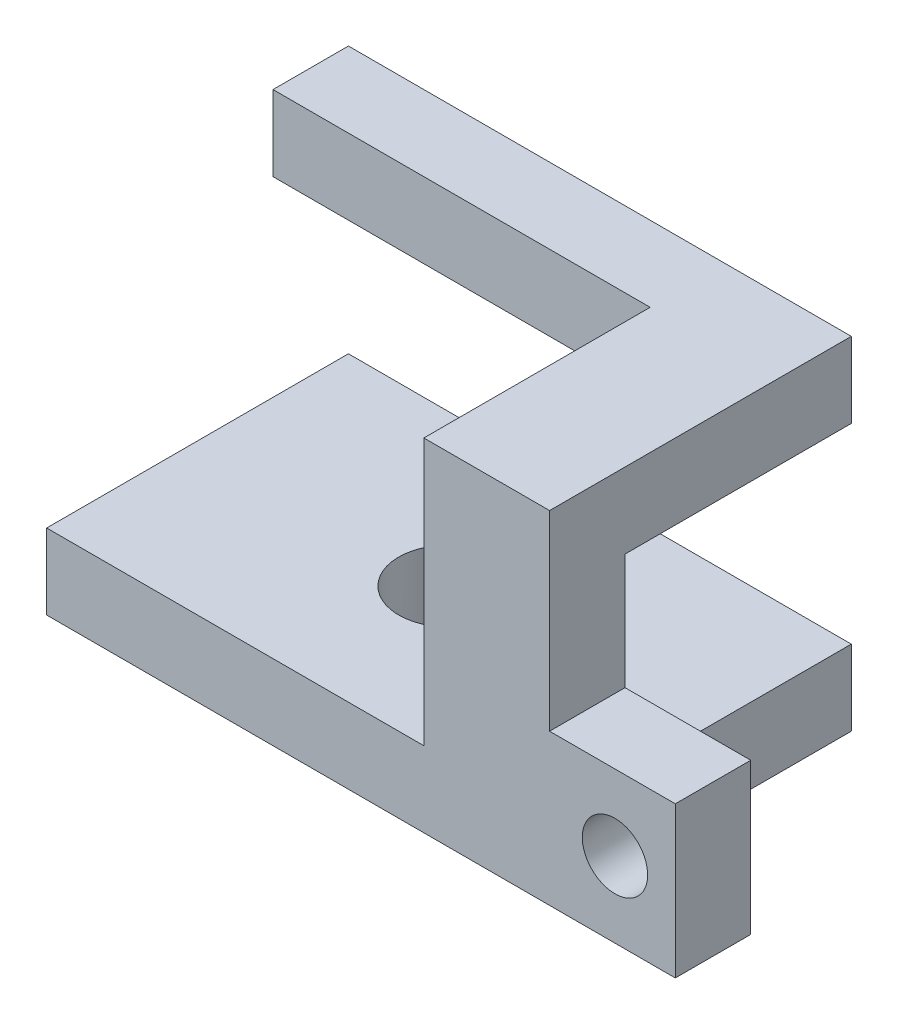
ISO-10303-21;
HEADER;
FILE_DESCRIPTION(('STEP AP214'),'2;1');
FILE_NAME('part.step','',(''),(''),'','','');
FILE_SCHEMA(('AUTOMOTIVE_DESIGN { 1 0 10303 214 1 1 1 1 }'));
ENDSEC;
DATA;
#1=APPLICATION_CONTEXT('core data for automotive mechanical design processes');
#2=APPLICATION_PROTOCOL_DEFINITION('international standard','automotive_design',2000,#1);
#3=PRODUCT_CONTEXT('',#1,'mechanical');
#4=PRODUCT('Part','Part','',(#3));
#5=PRODUCT_RELATED_PRODUCT_CATEGORY('part','',(#4));
#6=PRODUCT_DEFINITION_FORMATION('','',#4);
#7=PRODUCT_DEFINITION_CONTEXT('part definition',#1,'design');
#8=PRODUCT_DEFINITION('design','',#6,#7);
#9=PRODUCT_DEFINITION_SHAPE('','',#8);
#10=(LENGTH_UNIT() NAMED_UNIT(*) SI_UNIT(.MILLI.,.METRE.));
#11=(NAMED_UNIT(*) PLANE_ANGLE_UNIT() SI_UNIT($,.RADIAN.));
#12=(NAMED_UNIT(*) SI_UNIT($,.STERADIAN.) SOLID_ANGLE_UNIT());
#13=UNCERTAINTY_MEASURE_WITH_UNIT(LENGTH_MEASURE(1.E-05),#10,'distance_accuracy_value','');
#14=(GEOMETRIC_REPRESENTATION_CONTEXT(3) GLOBAL_UNCERTAINTY_ASSIGNED_CONTEXT((#13)) GLOBAL_UNIT_ASSIGNED_CONTEXT((#10,
#11,#12)) REPRESENTATION_CONTEXT('',''));
#15=CARTESIAN_POINT('',(0.,0.,0.));
#16=DIRECTION('',(0.,0.,1.));
#17=DIRECTION('',(1.,0.,0.));
#18=AXIS2_PLACEMENT_3D('',#15,#16,#17);
#19=CARTESIAN_POINT('',(-50.,68.,30.));
#20=DIRECTION('',(1.,0.,0.));
#21=DIRECTION('',(0.,0.,-1.));
#22=AXIS2_PLACEMENT_3D('',#19,#20,#21);
#23=PLANE('',#22);
#24=DIRECTION('',(0.,-1.,0.));
#25=VECTOR('',#24,1.);
#26=CARTESIAN_POINT('',(-50.,68.,30.));
#27=LINE('',#26,#25);
#28=CARTESIAN_POINT('',(-50.,15.,30.));
#29=VERTEX_POINT('',#28);
#30=CARTESIAN_POINT('',(-50.,0.,30.));
#31=VERTEX_POINT('',#30);
#32=EDGE_CURVE('E167',#29,#31,#27,.T.);
#33=ORIENTED_EDGE('',*,*,#32,.F.);
#34=DIRECTION('',(0.,0.,-1.));
#35=VECTOR('',#34,1.);
#36=CARTESIAN_POINT('',(-50.,15.,-30.));
#37=LINE('',#36,#35);
#38=CARTESIAN_POINT('',(-50.,15.,-30.));
#39=VERTEX_POINT('',#38);
#40=EDGE_CURVE('E202',#29,#39,#37,.T.);
#41=ORIENTED_EDGE('',*,*,#40,.T.);
#42=DIRECTION('',(0.,-1.,0.));
#43=VECTOR('',#42,1.);
#44=CARTESIAN_POINT('',(-50.,68.,-30.));
#45=LINE('',#44,#43);
#46=CARTESIAN_POINT('',(-50.,0.,-30.));
#47=VERTEX_POINT('',#46);
#48=EDGE_CURVE('E170',#39,#47,#45,.T.);
#49=ORIENTED_EDGE('',*,*,#48,.T.);
#50=DIRECTION('',(0.,0.,1.));
#51=VECTOR('',#50,1.);
#52=CARTESIAN_POINT('',(-50.,0.,30.));
#53=LINE('',#52,#51);
#54=EDGE_CURVE('E227',#47,#31,#53,.T.);
#55=ORIENTED_EDGE('',*,*,#54,.T.);
#56=EDGE_LOOP('',(#33,#41,#49,#55));
#57=FACE_BOUND('',#56,.T.);
#58=ADVANCED_FACE('F40',(#57),#23,.F.);
#59=CARTESIAN_POINT('',(-50.,68.,-30.));
#60=DIRECTION('',(0.,0.,1.));
#61=DIRECTION('',(1.,0.,0.));
#62=AXIS2_PLACEMENT_3D('',#59,#60,#61);
#63=PLANE('',#62);
#64=DIRECTION('',(1.,0.,0.));
#65=VECTOR('',#64,1.);
#66=CARTESIAN_POINT('',(-50.,15.,-30.));
#67=LINE('',#66,#65);
#68=CARTESIAN_POINT('',(50.,15.,-30.));
#69=VERTEX_POINT('',#68);
#70=EDGE_CURVE('E187',#39,#69,#67,.T.);
#71=ORIENTED_EDGE('',*,*,#70,.T.);
#72=DIRECTION('',(0.,1.,0.));
#73=VECTOR('',#72,1.);
#74=CARTESIAN_POINT('',(50.,0.,-30.));
#75=LINE('',#74,#73);
#76=CARTESIAN_POINT('',(50.,0.,-30.));
#77=VERTEX_POINT('',#76);
#78=EDGE_CURVE('E239',#77,#69,#75,.T.);
#79=ORIENTED_EDGE('',*,*,#78,.F.);
#80=DIRECTION('',(-1.,0.,0.));
#81=VECTOR('',#80,1.);
#82=CARTESIAN_POINT('',(-50.,0.,-30.));
#83=LINE('',#82,#81);
#84=EDGE_CURVE('E222',#77,#47,#83,.T.);
#85=ORIENTED_EDGE('',*,*,#84,.T.);
#86=ORIENTED_EDGE('',*,*,#48,.F.);
#87=EDGE_LOOP('',(#71,#79,#85,#86));
#88=FACE_BOUND('',#87,.T.);
#89=ADVANCED_FACE('F289',(#88),#63,.F.);
#90=CARTESIAN_POINT('',(0.,68.,0.));
#91=DIRECTION('',(0.,-1.,0.));
#92=DIRECTION('',(0.,0.,-1.));
#93=AXIS2_PLACEMENT_3D('',#90,#91,#92);
#94=CYLINDRICAL_SURFACE('',#93,10.);
#95=CARTESIAN_POINT('',(0.,15.,0.));
#96=DIRECTION('',(0.,-1.,0.));
#97=DIRECTION('',(0.,0.,-1.));
#98=AXIS2_PLACEMENT_3D('',#95,#96,#97);
#99=CIRCLE('',#98,10.);
#100=CARTESIAN_POINT('',(0.,15.,-10.));
#101=VERTEX_POINT('',#100);
#102=EDGE_CURVE('E183',#101,#101,#99,.T.);
#103=ORIENTED_EDGE('',*,*,#102,.F.);
#104=EDGE_LOOP('',(#103));
#105=FACE_BOUND('',#104,.T.);
#106=CARTESIAN_POINT('',(0.,0.,0.));
#107=DIRECTION('',(0.,1.,0.));
#108=DIRECTION('',(0.,0.,1.));
#109=AXIS2_PLACEMENT_3D('',#106,#107,#108);
#110=CIRCLE('',#109,10.);
#111=CARTESIAN_POINT('',(0.,0.,10.));
#112=VERTEX_POINT('',#111);
#113=EDGE_CURVE('E186',#112,#112,#110,.T.);
#114=ORIENTED_EDGE('',*,*,#113,.F.);
#115=EDGE_LOOP('',(#114));
#116=FACE_BOUND('',#115,.T.);
#117=ADVANCED_FACE('F305',(#105,#116),#94,.F.);
#118=CARTESIAN_POINT('',(0.,68.,0.));
#119=DIRECTION('',(0.,-1.,0.));
#120=DIRECTION('',(0.,0.,-1.));
#121=AXIS2_PLACEMENT_3D('',#118,#119,#120);
#122=PLANE('',#121);
#123=DIRECTION('',(1.,0.,0.));
#124=VECTOR('',#123,1.);
#125=CARTESIAN_POINT('',(-50.,68.,30.));
#126=LINE('',#125,#124);
#127=CARTESIAN_POINT('',(25.,68.,30.));
#128=VERTEX_POINT('',#127);
#129=CARTESIAN_POINT('',(50.,68.,30.));
#130=VERTEX_POINT('',#129);
#131=EDGE_CURVE('E168',#128,#130,#126,.T.);
#132=ORIENTED_EDGE('',*,*,#131,.T.);
#133=DIRECTION('',(0.,0.,1.));
#134=VECTOR('',#133,1.);
#135=CARTESIAN_POINT('',(50.,68.,-30.));
#136=LINE('',#135,#134);
#137=CARTESIAN_POINT('',(50.,68.,-30.));
#138=VERTEX_POINT('',#137);
#139=EDGE_CURVE('E255',#138,#130,#136,.T.);
#140=ORIENTED_EDGE('',*,*,#139,.F.);
#141=DIRECTION('',(-1.,0.,0.));
#142=VECTOR('',#141,1.);
#143=CARTESIAN_POINT('',(50.,68.,-30.));
#144=LINE('',#143,#142);
#145=CARTESIAN_POINT('',(-50.,68.,-30.));
#146=VERTEX_POINT('',#145);
#147=EDGE_CURVE('E223',#138,#146,#144,.T.);
#148=ORIENTED_EDGE('',*,*,#147,.T.);
#149=DIRECTION('',(0.,0.,1.));
#150=VECTOR('',#149,1.);
#151=CARTESIAN_POINT('',(-50.,68.,30.));
#152=LINE('',#151,#150);
#153=CARTESIAN_POINT('',(-50.,68.,-15.));
#154=VERTEX_POINT('',#153);
#155=EDGE_CURVE('E173',#146,#154,#152,.T.);
#156=ORIENTED_EDGE('',*,*,#155,.T.);
#157=DIRECTION('',(-1.,0.,0.));
#158=VECTOR('',#157,1.);
#159=CARTESIAN_POINT('',(-50.,68.,-15.));
#160=LINE('',#159,#158);
#161=CARTESIAN_POINT('',(25.,68.,-15.));
#162=VERTEX_POINT('',#161);
#163=EDGE_CURVE('E249',#162,#154,#160,.T.);
#164=ORIENTED_EDGE('',*,*,#163,.F.);
#165=DIRECTION('',(0.,0.,-1.));
#166=VECTOR('',#165,1.);
#167=CARTESIAN_POINT('',(25.,68.,-15.));
#168=LINE('',#167,#166);
#169=EDGE_CURVE('E252',#128,#162,#168,.T.);
#170=ORIENTED_EDGE('',*,*,#169,.F.);
#171=EDGE_LOOP('',(#132,#140,#148,#156,#164,#170));
#172=FACE_BOUND('',#171,.T.);
#173=ADVANCED_FACE('F276',(#172),#122,.F.);
#174=CARTESIAN_POINT('',(0.,0.,0.));
#175=DIRECTION('',(0.,-1.,0.));
#176=DIRECTION('',(0.,0.,-1.));
#177=AXIS2_PLACEMENT_3D('',#174,#175,#176);
#178=PLANE('',#177);
#179=DIRECTION('',(0.,0.,1.));
#180=VECTOR('',#179,1.);
#181=CARTESIAN_POINT('',(50.,0.,0.));
#182=LINE('',#181,#180);
#183=CARTESIAN_POINT('',(50.,0.,15.));
#184=VERTEX_POINT('',#183);
#185=EDGE_CURVE('E237',#77,#184,#182,.T.);
#186=ORIENTED_EDGE('',*,*,#185,.T.);
#187=DIRECTION('',(1.,0.,0.));
#188=VECTOR('',#187,1.);
#189=CARTESIAN_POINT('',(0.,0.,15.));
#190=LINE('',#189,#188);
#191=CARTESIAN_POINT('',(75.,0.,15.));
#192=VERTEX_POINT('',#191);
#193=EDGE_CURVE('E235',#184,#192,#190,.T.);
#194=ORIENTED_EDGE('',*,*,#193,.T.);
#195=DIRECTION('',(0.,0.,-1.));
#196=VECTOR('',#195,1.);
#197=CARTESIAN_POINT('',(75.,0.,-30.));
#198=LINE('',#197,#196);
#199=CARTESIAN_POINT('',(75.,0.,30.));
#200=VERTEX_POINT('',#199);
#201=EDGE_CURVE('E176',#200,#192,#198,.T.);
#202=ORIENTED_EDGE('',*,*,#201,.F.);
#203=DIRECTION('',(1.,0.,0.));
#204=VECTOR('',#203,1.);
#205=CARTESIAN_POINT('',(50.,0.,30.));
#206=LINE('',#205,#204);
#207=EDGE_CURVE('E165',#31,#200,#206,.T.);
#208=ORIENTED_EDGE('',*,*,#207,.F.);
#209=ORIENTED_EDGE('',*,*,#54,.F.);
#210=ORIENTED_EDGE('',*,*,#84,.F.);
#211=EDGE_LOOP('',(#186,#194,#202,#208,#209,#210));
#212=FACE_BOUND('',#211,.T.);
#213=ORIENTED_EDGE('',*,*,#113,.T.);
#214=EDGE_LOOP('',(#213));
#215=FACE_BOUND('',#214,.T.);
#216=ADVANCED_FACE('F232',(#212,#215),#178,.T.);
#217=ORIENTED_EDGE('',*,*,#147,.F.);
#218=DIRECTION('',(0.,1.,0.));
#219=VECTOR('',#218,1.);
#220=CARTESIAN_POINT('',(50.,-72.4642784226795,-30.));
#221=LINE('',#220,#219);
#222=CARTESIAN_POINT('',(50.,53.,-30.));
#223=VERTEX_POINT('',#222);
#224=EDGE_CURVE('E248',#223,#138,#221,.T.);
#225=ORIENTED_EDGE('',*,*,#224,.F.);
#226=DIRECTION('',(1.,0.,0.));
#227=VECTOR('',#226,1.);
#228=CARTESIAN_POINT('',(-50.,53.,-30.));
#229=LINE('',#228,#227);
#230=CARTESIAN_POINT('',(-50.,53.,-30.));
#231=VERTEX_POINT('',#230);
#232=EDGE_CURVE('E204',#231,#223,#229,.T.);
#233=ORIENTED_EDGE('',*,*,#232,.F.);
#234=EDGE_CURVE('E179',#146,#231,#45,.T.);
#235=ORIENTED_EDGE('',*,*,#234,.F.);
#236=EDGE_LOOP('',(#217,#225,#233,#235));
#237=FACE_BOUND('',#236,.T.);
#238=ADVANCED_FACE('F42',(#237),#63,.F.);
#239=DIRECTION('',(0.,0.,1.));
#240=VECTOR('',#239,1.);
#241=CARTESIAN_POINT('',(-50.,53.,-30.));
#242=LINE('',#241,#240);
#243=CARTESIAN_POINT('',(-50.,53.,-15.));
#244=VERTEX_POINT('',#243);
#245=EDGE_CURVE('E194',#231,#244,#242,.T.);
#246=ORIENTED_EDGE('',*,*,#245,.T.);
#247=DIRECTION('',(0.,1.,0.));
#248=VECTOR('',#247,1.);
#249=CARTESIAN_POINT('',(-50.,-72.4642784226795,-15.));
#250=LINE('',#249,#248);
#251=EDGE_CURVE('E63',#244,#154,#250,.T.);
#252=ORIENTED_EDGE('',*,*,#251,.T.);
#253=ORIENTED_EDGE('',*,*,#155,.F.);
#254=ORIENTED_EDGE('',*,*,#234,.T.);
#255=EDGE_LOOP('',(#246,#252,#253,#254));
#256=FACE_BOUND('',#255,.T.);
#257=ADVANCED_FACE('F198',(#256),#23,.F.);
#258=CARTESIAN_POINT('',(50.,68.,30.));
#259=DIRECTION('',(0.,0.,-1.));
#260=DIRECTION('',(-1.,0.,0.));
#261=AXIS2_PLACEMENT_3D('',#258,#259,#260);
#262=PLANE('',#261);
#263=CARTESIAN_POINT('',(63.,15.,30.));
#264=DIRECTION('',(0.,0.,-1.));
#265=DIRECTION('',(0.,1.,0.));
#266=AXIS2_PLACEMENT_3D('',#263,#264,#265);
#267=CIRCLE('',#266,6.5);
#268=CARTESIAN_POINT('',(63.,21.5,30.));
#269=VERTEX_POINT('',#268);
#270=EDGE_CURVE('E505',#269,#269,#267,.T.);
#271=ORIENTED_EDGE('',*,*,#270,.T.);
#272=EDGE_LOOP('',(#271));
#273=FACE_BOUND('',#272,.T.);
#274=DIRECTION('',(-1.,0.,0.));
#275=VECTOR('',#274,1.);
#276=CARTESIAN_POINT('',(75.,30.,30.));
#277=LINE('',#276,#275);
#278=CARTESIAN_POINT('',(75.,30.,30.));
#279=VERTEX_POINT('',#278);
#280=CARTESIAN_POINT('',(50.,30.,30.));
#281=VERTEX_POINT('',#280);
#282=EDGE_CURVE('E141',#279,#281,#277,.T.);
#283=ORIENTED_EDGE('',*,*,#282,.T.);
#284=DIRECTION('',(0.,1.,0.));
#285=VECTOR('',#284,1.);
#286=CARTESIAN_POINT('',(50.,68.,30.));
#287=LINE('',#286,#285);
#288=EDGE_CURVE('E152',#281,#130,#287,.T.);
#289=ORIENTED_EDGE('',*,*,#288,.T.);
#290=ORIENTED_EDGE('',*,*,#131,.F.);
#291=DIRECTION('',(0.,1.,0.));
#292=VECTOR('',#291,1.);
#293=CARTESIAN_POINT('',(25.,-72.4642784226795,30.));
#294=LINE('',#293,#292);
#295=CARTESIAN_POINT('',(25.,15.,30.));
#296=VERTEX_POINT('',#295);
#297=EDGE_CURVE('E258',#296,#128,#294,.T.);
#298=ORIENTED_EDGE('',*,*,#297,.F.);
#299=DIRECTION('',(1.,0.,0.));
#300=VECTOR('',#299,1.);
#301=CARTESIAN_POINT('',(-50.,15.,30.));
#302=LINE('',#301,#300);
#303=EDGE_CURVE('E251',#29,#296,#302,.T.);
#304=ORIENTED_EDGE('',*,*,#303,.F.);
#305=ORIENTED_EDGE('',*,*,#32,.T.);
#306=ORIENTED_EDGE('',*,*,#207,.T.);
#307=DIRECTION('',(0.,-1.,0.));
#308=VECTOR('',#307,1.);
#309=CARTESIAN_POINT('',(75.,68.,30.));
#310=LINE('',#309,#308);
#311=EDGE_CURVE('E159',#279,#200,#310,.T.);
#312=ORIENTED_EDGE('',*,*,#311,.F.);
#313=EDGE_LOOP('',(#283,#289,#290,#298,#304,#305,#306,#312));
#314=FACE_BOUND('',#313,.T.);
#315=ADVANCED_FACE('F163',(#273,#314),#262,.F.);
#316=CARTESIAN_POINT('',(75.,68.,-30.));
#317=DIRECTION('',(-1.,0.,0.));
#318=DIRECTION('',(0.,0.,1.));
#319=AXIS2_PLACEMENT_3D('',#316,#317,#318);
#320=PLANE('',#319);
#321=DIRECTION('',(0.,-1.,0.));
#322=VECTOR('',#321,1.);
#323=CARTESIAN_POINT('',(75.,53.,15.));
#324=LINE('',#323,#322);
#325=CARTESIAN_POINT('',(75.,30.,15.));
#326=VERTEX_POINT('',#325);
#327=EDGE_CURVE('E161',#326,#192,#324,.T.);
#328=ORIENTED_EDGE('',*,*,#327,.F.);
#329=DIRECTION('',(0.,0.,-1.));
#330=VECTOR('',#329,1.);
#331=CARTESIAN_POINT('',(75.,30.,30.));
#332=LINE('',#331,#330);
#333=EDGE_CURVE('E145',#279,#326,#332,.T.);
#334=ORIENTED_EDGE('',*,*,#333,.F.);
#335=ORIENTED_EDGE('',*,*,#311,.T.);
#336=ORIENTED_EDGE('',*,*,#201,.T.);
#337=EDGE_LOOP('',(#328,#334,#335,#336));
#338=FACE_BOUND('',#337,.T.);
#339=ADVANCED_FACE('F157',(#338),#320,.F.);
#340=CARTESIAN_POINT('',(-50.,15.,-30.));
#341=DIRECTION('',(0.,-1.,0.));
#342=DIRECTION('',(0.,0.,-1.));
#343=AXIS2_PLACEMENT_3D('',#340,#341,#342);
#344=PLANE('',#343);
#345=DIRECTION('',(1.,0.,0.));
#346=VECTOR('',#345,1.);
#347=CARTESIAN_POINT('',(-50.,15.,15.));
#348=LINE('',#347,#346);
#349=CARTESIAN_POINT('',(25.,15.,15.));
#350=VERTEX_POINT('',#349);
#351=CARTESIAN_POINT('',(50.,15.,15.));
#352=VERTEX_POINT('',#351);
#353=EDGE_CURVE('E213',#350,#352,#348,.T.);
#354=ORIENTED_EDGE('',*,*,#353,.T.);
#355=DIRECTION('',(0.,0.,-1.));
#356=VECTOR('',#355,1.);
#357=CARTESIAN_POINT('',(50.,15.,-30.));
#358=LINE('',#357,#356);
#359=EDGE_CURVE('E244',#352,#69,#358,.T.);
#360=ORIENTED_EDGE('',*,*,#359,.T.);
#361=ORIENTED_EDGE('',*,*,#70,.F.);
#362=ORIENTED_EDGE('',*,*,#40,.F.);
#363=ORIENTED_EDGE('',*,*,#303,.T.);
#364=DIRECTION('',(0.,0.,-1.));
#365=VECTOR('',#364,1.);
#366=CARTESIAN_POINT('',(25.,15.,-15.));
#367=LINE('',#366,#365);
#368=EDGE_CURVE('E259',#296,#350,#367,.T.);
#369=ORIENTED_EDGE('',*,*,#368,.T.);
#370=EDGE_LOOP('',(#354,#360,#361,#362,#363,#369));
#371=FACE_BOUND('',#370,.T.);
#372=ORIENTED_EDGE('',*,*,#102,.T.);
#373=EDGE_LOOP('',(#372));
#374=FACE_BOUND('',#373,.T.);
#375=ADVANCED_FACE('F292',(#371,#374),#344,.F.);
#376=CARTESIAN_POINT('',(-50.,53.,15.));
#377=DIRECTION('',(0.,0.,1.));
#378=DIRECTION('',(0.,-1.,0.));
#379=AXIS2_PLACEMENT_3D('',#376,#377,#378);
#380=PLANE('',#379);
#381=CARTESIAN_POINT('',(63.,15.,15.));
#382=DIRECTION('',(0.,0.,-1.));
#383=DIRECTION('',(0.,1.,0.));
#384=AXIS2_PLACEMENT_3D('',#381,#382,#383);
#385=CIRCLE('',#384,6.5);
#386=CARTESIAN_POINT('',(63.,21.5,15.));
#387=VERTEX_POINT('',#386);
#388=EDGE_CURVE('E508',#387,#387,#385,.T.);
#389=ORIENTED_EDGE('',*,*,#388,.F.);
#390=EDGE_LOOP('',(#389));
#391=FACE_BOUND('',#390,.T.);
#392=DIRECTION('',(1.,0.,0.));
#393=VECTOR('',#392,1.);
#394=CARTESIAN_POINT('',(-50.,53.,15.));
#395=LINE('',#394,#393);
#396=CARTESIAN_POINT('',(25.,53.,15.));
#397=VERTEX_POINT('',#396);
#398=CARTESIAN_POINT('',(50.,53.,15.));
#399=VERTEX_POINT('',#398);
#400=EDGE_CURVE('E216',#397,#399,#395,.T.);
#401=ORIENTED_EDGE('',*,*,#400,.T.);
#402=DIRECTION('',(0.,1.,0.));
#403=VECTOR('',#402,1.);
#404=CARTESIAN_POINT('',(50.,68.,15.));
#405=LINE('',#404,#403);
#406=CARTESIAN_POINT('',(50.,30.,15.));
#407=VERTEX_POINT('',#406);
#408=EDGE_CURVE('E153',#407,#399,#405,.T.);
#409=ORIENTED_EDGE('',*,*,#408,.F.);
#410=DIRECTION('',(-1.,0.,0.));
#411=VECTOR('',#410,1.);
#412=CARTESIAN_POINT('',(75.,30.,15.));
#413=LINE('',#412,#411);
#414=EDGE_CURVE('E509',#326,#407,#413,.T.);
#415=ORIENTED_EDGE('',*,*,#414,.F.);
#416=ORIENTED_EDGE('',*,*,#327,.T.);
#417=ORIENTED_EDGE('',*,*,#193,.F.);
#418=DIRECTION('',(0.,1.,0.));
#419=VECTOR('',#418,1.);
#420=CARTESIAN_POINT('',(50.,0.,15.));
#421=LINE('',#420,#419);
#422=EDGE_CURVE('E55',#184,#352,#421,.T.);
#423=ORIENTED_EDGE('',*,*,#422,.T.);
#424=ORIENTED_EDGE('',*,*,#353,.F.);
#425=DIRECTION('',(0.,1.,0.));
#426=VECTOR('',#425,1.);
#427=CARTESIAN_POINT('',(25.,53.,15.));
#428=LINE('',#427,#426);
#429=EDGE_CURVE('E206',#350,#397,#428,.T.);
#430=ORIENTED_EDGE('',*,*,#429,.T.);
#431=EDGE_LOOP('',(#401,#409,#415,#416,#417,#423,#424,#430));
#432=FACE_BOUND('',#431,.T.);
#433=ADVANCED_FACE('F295',(#391,#432),#380,.F.);
#434=CARTESIAN_POINT('',(-50.,53.,-30.));
#435=DIRECTION('',(0.,1.,0.));
#436=DIRECTION('',(0.,0.,1.));
#437=AXIS2_PLACEMENT_3D('',#434,#435,#436);
#438=PLANE('',#437);
#439=ORIENTED_EDGE('',*,*,#400,.F.);
#440=DIRECTION('',(0.,0.,-1.));
#441=VECTOR('',#440,1.);
#442=CARTESIAN_POINT('',(25.,53.,-30.));
#443=LINE('',#442,#441);
#444=CARTESIAN_POINT('',(25.,53.,-15.));
#445=VERTEX_POINT('',#444);
#446=EDGE_CURVE('E11',#397,#445,#443,.T.);
#447=ORIENTED_EDGE('',*,*,#446,.T.);
#448=DIRECTION('',(-1.,0.,0.));
#449=VECTOR('',#448,1.);
#450=CARTESIAN_POINT('',(-50.,53.,-15.));
#451=LINE('',#450,#449);
#452=EDGE_CURVE('E48',#445,#244,#451,.T.);
#453=ORIENTED_EDGE('',*,*,#452,.T.);
#454=ORIENTED_EDGE('',*,*,#245,.F.);
#455=ORIENTED_EDGE('',*,*,#232,.T.);
#456=DIRECTION('',(0.,0.,1.));
#457=VECTOR('',#456,1.);
#458=CARTESIAN_POINT('',(50.,53.,-30.));
#459=LINE('',#458,#457);
#460=EDGE_CURVE('E182',#223,#399,#459,.T.);
#461=ORIENTED_EDGE('',*,*,#460,.T.);
#462=EDGE_LOOP('',(#439,#447,#453,#454,#455,#461));
#463=FACE_BOUND('',#462,.T.);
#464=ADVANCED_FACE('F192',(#463),#438,.F.);
#465=CARTESIAN_POINT('',(50.,-72.4642784226795,-30.));
#466=DIRECTION('',(-1.,0.,0.));
#467=DIRECTION('',(0.,0.,1.));
#468=AXIS2_PLACEMENT_3D('',#465,#466,#467);
#469=PLANE('',#468);
#470=ORIENTED_EDGE('',*,*,#224,.T.);
#471=ORIENTED_EDGE('',*,*,#139,.T.);
#472=ORIENTED_EDGE('',*,*,#288,.F.);
#473=DIRECTION('',(0.,0.,-1.));
#474=VECTOR('',#473,1.);
#475=CARTESIAN_POINT('',(50.,30.,30.));
#476=LINE('',#475,#474);
#477=EDGE_CURVE('E147',#281,#407,#476,.T.);
#478=ORIENTED_EDGE('',*,*,#477,.T.);
#479=ORIENTED_EDGE('',*,*,#408,.T.);
#480=ORIENTED_EDGE('',*,*,#460,.F.);
#481=EDGE_LOOP('',(#470,#471,#472,#478,#479,#480));
#482=FACE_BOUND('',#481,.T.);
#483=ADVANCED_FACE('F268',(#482),#469,.F.);
#484=CARTESIAN_POINT('',(25.,-72.4642784226795,-15.));
#485=DIRECTION('',(1.,0.,0.));
#486=DIRECTION('',(0.,0.,-1.));
#487=AXIS2_PLACEMENT_3D('',#484,#485,#486);
#488=PLANE('',#487);
#489=ORIENTED_EDGE('',*,*,#368,.F.);
#490=ORIENTED_EDGE('',*,*,#297,.T.);
#491=ORIENTED_EDGE('',*,*,#169,.T.);
#492=DIRECTION('',(0.,1.,0.));
#493=VECTOR('',#492,1.);
#494=CARTESIAN_POINT('',(25.,-72.4642784226795,-15.));
#495=LINE('',#494,#493);
#496=EDGE_CURVE('E262',#445,#162,#495,.T.);
#497=ORIENTED_EDGE('',*,*,#496,.F.);
#498=ORIENTED_EDGE('',*,*,#446,.F.);
#499=ORIENTED_EDGE('',*,*,#429,.F.);
#500=EDGE_LOOP('',(#489,#490,#491,#497,#498,#499));
#501=FACE_BOUND('',#500,.T.);
#502=ADVANCED_FACE('F279',(#501),#488,.F.);
#503=CARTESIAN_POINT('',(-50.,-72.4642784226795,-15.));
#504=DIRECTION('',(0.,0.,-1.));
#505=DIRECTION('',(-1.,0.,0.));
#506=AXIS2_PLACEMENT_3D('',#503,#504,#505);
#507=PLANE('',#506);
#508=ORIENTED_EDGE('',*,*,#496,.T.);
#509=ORIENTED_EDGE('',*,*,#163,.T.);
#510=ORIENTED_EDGE('',*,*,#251,.F.);
#511=ORIENTED_EDGE('',*,*,#452,.F.);
#512=EDGE_LOOP('',(#508,#509,#510,#511));
#513=FACE_BOUND('',#512,.T.);
#514=ADVANCED_FACE('F331',(#513),#507,.F.);
#515=CARTESIAN_POINT('',(50.,0.,0.));
#516=DIRECTION('',(-1.,0.,0.));
#517=DIRECTION('',(0.,0.,1.));
#518=AXIS2_PLACEMENT_3D('',#515,#516,#517);
#519=PLANE('',#518);
#520=ORIENTED_EDGE('',*,*,#422,.F.);
#521=ORIENTED_EDGE('',*,*,#185,.F.);
#522=ORIENTED_EDGE('',*,*,#78,.T.);
#523=ORIENTED_EDGE('',*,*,#359,.F.);
#524=EDGE_LOOP('',(#520,#521,#522,#523));
#525=FACE_BOUND('',#524,.T.);
#526=ADVANCED_FACE('F291',(#525),#519,.F.);
#527=CARTESIAN_POINT('',(75.,30.,30.));
#528=DIRECTION('',(0.,-1.,0.));
#529=DIRECTION('',(1.,0.,0.));
#530=AXIS2_PLACEMENT_3D('',#527,#528,#529);
#531=PLANE('',#530);
#532=ORIENTED_EDGE('',*,*,#414,.T.);
#533=ORIENTED_EDGE('',*,*,#477,.F.);
#534=ORIENTED_EDGE('',*,*,#282,.F.);
#535=ORIENTED_EDGE('',*,*,#333,.T.);
#536=EDGE_LOOP('',(#532,#533,#534,#535));
#537=FACE_BOUND('',#536,.T.);
#538=ADVANCED_FACE('F144',(#537),#531,.F.);
#539=CARTESIAN_POINT('',(63.,15.,30.));
#540=DIRECTION('',(0.,0.,-1.));
#541=DIRECTION('',(0.,1.,0.));
#542=AXIS2_PLACEMENT_3D('',#539,#540,#541);
#543=CYLINDRICAL_SURFACE('',#542,6.5);
#544=ORIENTED_EDGE('',*,*,#270,.F.);
#545=EDGE_LOOP('',(#544));
#546=FACE_BOUND('',#545,.T.);
#547=ORIENTED_EDGE('',*,*,#388,.T.);
#548=EDGE_LOOP('',(#547));
#549=FACE_BOUND('',#548,.T.);
#550=ADVANCED_FACE('F336',(#546,#549),#543,.F.);
#551=CLOSED_SHELL('',(#58,#89,#117,#173,#216,#238,#257,#315,#339,#375,#433,#464,#483,#502,#514,
#526,#538,#550));
#552=MANIFOLD_SOLID_BREP('B2',#551);
#553=ADVANCED_BREP_SHAPE_REPRESENTATION('',(#18,#552),#14);
#554=SHAPE_DEFINITION_REPRESENTATION(#9,#553);
ENDSEC;
END-ISO-10303-21;
